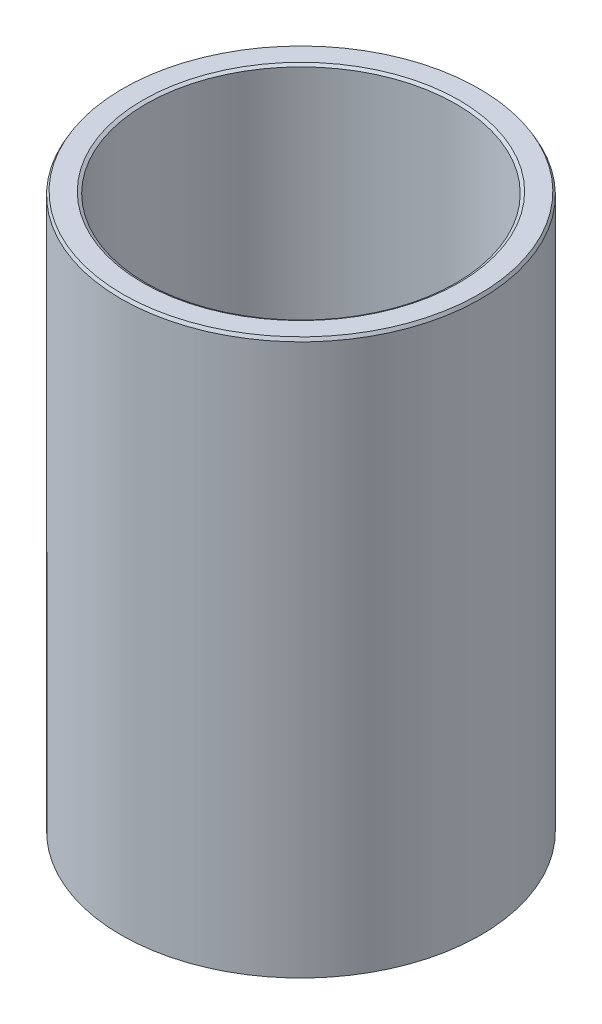
ISO-10303-21;
HEADER;
FILE_DESCRIPTION(('STEP AP214'),'2;1');
FILE_NAME('part.step','',(''),(''),'','','');
FILE_SCHEMA(('AUTOMOTIVE_DESIGN { 1 0 10303 214 1 1 1 1 }'));
ENDSEC;
DATA;
#1=APPLICATION_CONTEXT('core data for automotive mechanical design processes');
#2=APPLICATION_PROTOCOL_DEFINITION('international standard','automotive_design',2000,#1);
#3=PRODUCT_CONTEXT('',#1,'mechanical');
#4=PRODUCT('Part','Part','',(#3));
#5=PRODUCT_RELATED_PRODUCT_CATEGORY('part','',(#4));
#6=PRODUCT_DEFINITION_FORMATION('','',#4);
#7=PRODUCT_DEFINITION_CONTEXT('part definition',#1,'design');
#8=PRODUCT_DEFINITION('design','',#6,#7);
#9=PRODUCT_DEFINITION_SHAPE('','',#8);
#10=(LENGTH_UNIT() NAMED_UNIT(*) SI_UNIT(.MILLI.,.METRE.));
#11=(NAMED_UNIT(*) PLANE_ANGLE_UNIT() SI_UNIT($,.RADIAN.));
#12=(NAMED_UNIT(*) SI_UNIT($,.STERADIAN.) SOLID_ANGLE_UNIT());
#13=UNCERTAINTY_MEASURE_WITH_UNIT(LENGTH_MEASURE(1.E-05),#10,'distance_accuracy_value','');
#14=(GEOMETRIC_REPRESENTATION_CONTEXT(3) GLOBAL_UNCERTAINTY_ASSIGNED_CONTEXT((#13)) GLOBAL_UNIT_ASSIGNED_CONTEXT((#10,
#11,#12)) REPRESENTATION_CONTEXT('',''));
#15=CARTESIAN_POINT('',(0.,0.,0.));
#16=DIRECTION('',(0.,0.,1.));
#17=DIRECTION('',(1.,0.,0.));
#18=AXIS2_PLACEMENT_3D('',#15,#16,#17);
#19=CARTESIAN_POINT('',(0.,131.298463846406,0.));
#20=DIRECTION('',(0.,-1.,0.));
#21=DIRECTION('',(0.,0.,-1.));
#22=AXIS2_PLACEMENT_3D('',#19,#20,#21);
#23=CYLINDRICAL_SURFACE('',#22,42.5);
#24=CARTESIAN_POINT('',(0.,0.421869105014017,0.));
#25=DIRECTION('',(0.,1.,0.));
#26=DIRECTION('',(0.,0.,1.));
#27=AXIS2_PLACEMENT_3D('',#24,#25,#26);
#28=CIRCLE('',#27,42.5);
#29=CARTESIAN_POINT('',(0.,0.421869105014017,42.5));
#30=VERTEX_POINT('',#29);
#31=EDGE_CURVE('E10',#30,#30,#28,.T.);
#32=ORIENTED_EDGE('',*,*,#31,.T.);
#33=EDGE_LOOP('',(#32));
#34=FACE_BOUND('',#33,.T.);
#35=CARTESIAN_POINT('',(0.,130.567765122378,0.));
#36=DIRECTION('',(0.,1.,0.));
#37=DIRECTION('',(0.,0.,1.));
#38=AXIS2_PLACEMENT_3D('',#35,#36,#37);
#39=CIRCLE('',#38,42.5);
#40=CARTESIAN_POINT('',(0.,130.567765122378,42.5));
#41=VERTEX_POINT('',#40);
#42=EDGE_CURVE('E50',#41,#41,#39,.F.);
#43=ORIENTED_EDGE('',*,*,#42,.T.);
#44=EDGE_LOOP('',(#43));
#45=FACE_BOUND('',#44,.T.);
#46=ADVANCED_FACE('F39',(#34,#45),#23,.T.);
#47=CARTESIAN_POINT('',(0.,131.298463846406,0.));
#48=DIRECTION('',(0.,1.,0.));
#49=DIRECTION('',(0.,0.,1.));
#50=AXIS2_PLACEMENT_3D('',#47,#48,#49);
#51=PLANE('',#50);
#52=CARTESIAN_POINT('',(0.,131.298463846406,0.));
#53=DIRECTION('',(0.,1.,0.));
#54=DIRECTION('',(0.,0.,1.));
#55=AXIS2_PLACEMENT_3D('',#52,#53,#54);
#56=CIRCLE('',#55,37.3641219370982);
#57=CARTESIAN_POINT('',(0.,131.298463846406,37.3641219370982));
#58=VERTEX_POINT('',#57);
#59=EDGE_CURVE('E58',#58,#58,#56,.F.);
#60=ORIENTED_EDGE('',*,*,#59,.T.);
#61=EDGE_LOOP('',(#60));
#62=FACE_BOUND('',#61,.T.);
#63=CARTESIAN_POINT('',(0.,131.298463846406,0.));
#64=DIRECTION('',(0.,1.,0.));
#65=DIRECTION('',(0.,0.,1.));
#66=AXIS2_PLACEMENT_3D('',#63,#64,#65);
#67=CIRCLE('',#66,42.078130894986);
#68=CARTESIAN_POINT('',(0.,131.298463846406,42.078130894986));
#69=VERTEX_POINT('',#68);
#70=EDGE_CURVE('E61',#69,#69,#67,.T.);
#71=ORIENTED_EDGE('',*,*,#70,.T.);
#72=EDGE_LOOP('',(#71));
#73=FACE_BOUND('',#72,.T.);
#74=ADVANCED_FACE('F88',(#62,#73),#51,.T.);
#75=CARTESIAN_POINT('',(0.,0.,0.));
#76=DIRECTION('',(0.,1.,0.));
#77=DIRECTION('',(0.,0.,1.));
#78=AXIS2_PLACEMENT_3D('',#75,#76,#77);
#79=PLANE('',#78);
#80=CARTESIAN_POINT('',(0.,0.,0.));
#81=DIRECTION('',(0.,1.,0.));
#82=DIRECTION('',(0.,0.,1.));
#83=AXIS2_PLACEMENT_3D('',#80,#81,#82);
#84=CIRCLE('',#83,37.0552923180843);
#85=CARTESIAN_POINT('',(0.,0.,37.0552923180843));
#86=VERTEX_POINT('',#85);
#87=EDGE_CURVE('E51',#86,#86,#84,.T.);
#88=ORIENTED_EDGE('',*,*,#87,.T.);
#89=EDGE_LOOP('',(#88));
#90=FACE_BOUND('',#89,.T.);
#91=CARTESIAN_POINT('',(0.,0.,0.));
#92=DIRECTION('',(0.,1.,0.));
#93=DIRECTION('',(0.,0.,1.));
#94=AXIS2_PLACEMENT_3D('',#91,#92,#93);
#95=CIRCLE('',#94,41.7693012759721);
#96=CARTESIAN_POINT('',(0.,0.,41.7693012759721));
#97=VERTEX_POINT('',#96);
#98=EDGE_CURVE('E54',#97,#97,#95,.F.);
#99=ORIENTED_EDGE('',*,*,#98,.T.);
#100=EDGE_LOOP('',(#99));
#101=FACE_BOUND('',#100,.T.);
#102=ADVANCED_FACE('F83',(#90,#101),#79,.F.);
#103=CARTESIAN_POINT('',(0.,131.298463846406,0.));
#104=DIRECTION('',(0.,-1.,0.));
#105=DIRECTION('',(0.,0.,-1.));
#106=AXIS2_PLACEMENT_3D('',#103,#104,#105);
#107=CYLINDRICAL_SURFACE('',#106,36.6334232130703);
#108=CARTESIAN_POINT('',(0.,130.876594741392,0.));
#109=DIRECTION('',(0.,1.,0.));
#110=DIRECTION('',(0.,0.,1.));
#111=AXIS2_PLACEMENT_3D('',#108,#109,#110);
#112=CIRCLE('',#111,36.6334232130703);
#113=CARTESIAN_POINT('',(0.,130.876594741392,36.6334232130703));
#114=VERTEX_POINT('',#113);
#115=EDGE_CURVE('E67',#114,#114,#112,.T.);
#116=ORIENTED_EDGE('',*,*,#115,.T.);
#117=EDGE_LOOP('',(#116));
#118=FACE_BOUND('',#117,.T.);
#119=CARTESIAN_POINT('',(0.,0.730698724027895,0.));
#120=DIRECTION('',(0.,1.,0.));
#121=DIRECTION('',(0.,0.,1.));
#122=AXIS2_PLACEMENT_3D('',#119,#120,#121);
#123=CIRCLE('',#122,36.6334232130703);
#124=CARTESIAN_POINT('',(0.,0.730698724027895,36.6334232130703));
#125=VERTEX_POINT('',#124);
#126=EDGE_CURVE('E69',#125,#125,#123,.F.);
#127=ORIENTED_EDGE('',*,*,#126,.T.);
#128=EDGE_LOOP('',(#127));
#129=FACE_BOUND('',#128,.T.);
#130=ADVANCED_FACE('F71',(#118,#129),#107,.F.);
#131=CARTESIAN_POINT('',(0.,130.876594741392,0.));
#132=DIRECTION('',(0.,1.,0.));
#133=DIRECTION('',(0.,0.,1.));
#134=AXIS2_PLACEMENT_3D('',#131,#132,#133);
#135=CONICAL_SURFACE('',#134,36.6334232130703,1.04719755119659);
#136=ORIENTED_EDGE('',*,*,#59,.F.);
#137=EDGE_LOOP('',(#136));
#138=FACE_BOUND('',#137,.T.);
#139=ORIENTED_EDGE('',*,*,#115,.F.);
#140=EDGE_LOOP('',(#139));
#141=FACE_BOUND('',#140,.T.);
#142=ADVANCED_FACE('F77',(#138,#141),#135,.F.);
#143=CARTESIAN_POINT('',(0.,0.,0.));
#144=DIRECTION('',(0.,-1.,0.));
#145=DIRECTION('',(0.,0.,-1.));
#146=AXIS2_PLACEMENT_3D('',#143,#144,#145);
#147=CONICAL_SURFACE('',#146,37.0552923180843,0.523598775598301);
#148=ORIENTED_EDGE('',*,*,#126,.F.);
#149=EDGE_LOOP('',(#148));
#150=FACE_BOUND('',#149,.T.);
#151=ORIENTED_EDGE('',*,*,#87,.F.);
#152=EDGE_LOOP('',(#151));
#153=FACE_BOUND('',#152,.T.);
#154=ADVANCED_FACE('F73',(#150,#153),#147,.F.);
#155=CARTESIAN_POINT('',(0.,0.421869105014017,0.));
#156=DIRECTION('',(0.,1.,0.));
#157=DIRECTION('',(0.,0.,1.));
#158=AXIS2_PLACEMENT_3D('',#155,#156,#157);
#159=CONICAL_SURFACE('',#158,42.5,1.04719755119662);
#160=ORIENTED_EDGE('',*,*,#98,.F.);
#161=EDGE_LOOP('',(#160));
#162=FACE_BOUND('',#161,.T.);
#163=ORIENTED_EDGE('',*,*,#31,.F.);
#164=EDGE_LOOP('',(#163));
#165=FACE_BOUND('',#164,.T.);
#166=ADVANCED_FACE('F76',(#162,#165),#159,.T.);
#167=CARTESIAN_POINT('',(0.,131.298463846406,0.));
#168=DIRECTION('',(0.,-1.,0.));
#169=DIRECTION('',(0.,0.,-1.));
#170=AXIS2_PLACEMENT_3D('',#167,#168,#169);
#171=CONICAL_SURFACE('',#170,42.078130894986,0.52359877559832);
#172=ORIENTED_EDGE('',*,*,#42,.F.);
#173=EDGE_LOOP('',(#172));
#174=FACE_BOUND('',#173,.T.);
#175=ORIENTED_EDGE('',*,*,#70,.F.);
#176=EDGE_LOOP('',(#175));
#177=FACE_BOUND('',#176,.T.);
#178=ADVANCED_FACE('F45',(#174,#177),#171,.T.);
#179=CLOSED_SHELL('',(#46,#74,#102,#130,#142,#154,#166,#178));
#180=MANIFOLD_SOLID_BREP('B2',#179);
#181=ADVANCED_BREP_SHAPE_REPRESENTATION('',(#18,#180),#14);
#182=SHAPE_DEFINITION_REPRESENTATION(#9,#181);
ENDSEC;
END-ISO-10303-21;
